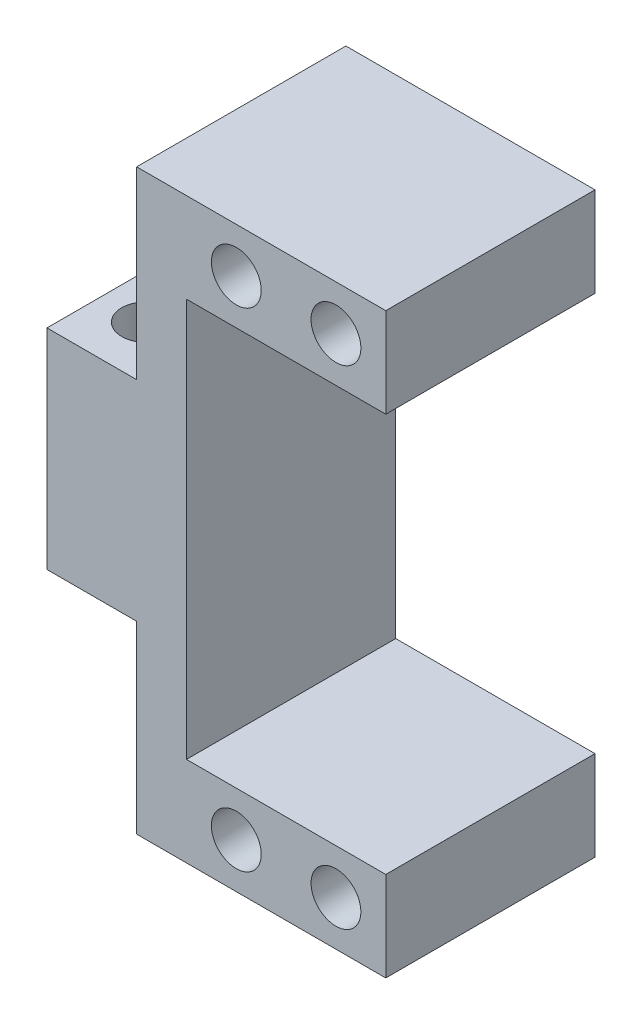
ISO-10303-21;
HEADER;
FILE_DESCRIPTION(('STEP AP214'),'2;1');
FILE_NAME('part.step','',(''),(''),'','','');
FILE_SCHEMA(('AUTOMOTIVE_DESIGN { 1 0 10303 214 1 1 1 1 }'));
ENDSEC;
DATA;
#1=APPLICATION_CONTEXT('core data for automotive mechanical design processes');
#2=APPLICATION_PROTOCOL_DEFINITION('international standard','automotive_design',2000,#1);
#3=PRODUCT_CONTEXT('',#1,'mechanical');
#4=PRODUCT('Part','Part','',(#3));
#5=PRODUCT_RELATED_PRODUCT_CATEGORY('part','',(#4));
#6=PRODUCT_DEFINITION_FORMATION('','',#4);
#7=PRODUCT_DEFINITION_CONTEXT('part definition',#1,'design');
#8=PRODUCT_DEFINITION('design','',#6,#7);
#9=PRODUCT_DEFINITION_SHAPE('','',#8);
#10=(LENGTH_UNIT() NAMED_UNIT(*) SI_UNIT(.MILLI.,.METRE.));
#11=(NAMED_UNIT(*) PLANE_ANGLE_UNIT() SI_UNIT($,.RADIAN.));
#12=(NAMED_UNIT(*) SI_UNIT($,.STERADIAN.) SOLID_ANGLE_UNIT());
#13=UNCERTAINTY_MEASURE_WITH_UNIT(LENGTH_MEASURE(1.E-05),#10,'distance_accuracy_value','');
#14=(GEOMETRIC_REPRESENTATION_CONTEXT(3) GLOBAL_UNCERTAINTY_ASSIGNED_CONTEXT((#13)) GLOBAL_UNIT_ASSIGNED_CONTEXT((#10,
#11,#12)) REPRESENTATION_CONTEXT('',''));
#15=CARTESIAN_POINT('',(0.,0.,0.));
#16=DIRECTION('',(0.,0.,1.));
#17=DIRECTION('',(1.,0.,0.));
#18=AXIS2_PLACEMENT_3D('',#15,#16,#17);
#19=CARTESIAN_POINT('',(0.,10.5,21.));
#20=DIRECTION('',(0.,-1.,0.));
#21=DIRECTION('',(0.,0.,-1.));
#22=AXIS2_PLACEMENT_3D('',#19,#20,#21);
#23=PLANE('',#22);
#24=CARTESIAN_POINT('',(4.5,10.5,15.5));
#25=DIRECTION('',(0.,1.,0.));
#26=DIRECTION('',(0.,0.,-1.));
#27=AXIS2_PLACEMENT_3D('',#24,#25,#26);
#28=CIRCLE('',#27,2.5);
#29=CARTESIAN_POINT('',(4.5,10.5,13.));
#30=VERTEX_POINT('',#29);
#31=EDGE_CURVE('E213',#30,#30,#28,.T.);
#32=ORIENTED_EDGE('',*,*,#31,.F.);
#33=EDGE_LOOP('',(#32));
#34=FACE_BOUND('',#33,.T.);
#35=CARTESIAN_POINT('',(4.5,10.5,5.5));
#36=DIRECTION('',(0.,1.,0.));
#37=DIRECTION('',(0.,0.,1.));
#38=AXIS2_PLACEMENT_3D('',#35,#36,#37);
#39=CIRCLE('',#38,2.5);
#40=CARTESIAN_POINT('',(4.5,10.5,8.));
#41=VERTEX_POINT('',#40);
#42=EDGE_CURVE('E202',#41,#41,#39,.T.);
#43=ORIENTED_EDGE('',*,*,#42,.F.);
#44=EDGE_LOOP('',(#43));
#45=FACE_BOUND('',#44,.T.);
#46=DIRECTION('',(-1.,0.,0.));
#47=VECTOR('',#46,1.);
#48=CARTESIAN_POINT('',(0.,10.5,0.));
#49=LINE('',#48,#47);
#50=CARTESIAN_POINT('',(9.,10.5,0.));
#51=VERTEX_POINT('',#50);
#52=CARTESIAN_POINT('',(0.,10.5,0.));
#53=VERTEX_POINT('',#52);
#54=EDGE_CURVE('E153',#51,#53,#49,.T.);
#55=ORIENTED_EDGE('',*,*,#54,.T.);
#56=DIRECTION('',(0.,0.,-1.));
#57=VECTOR('',#56,1.);
#58=CARTESIAN_POINT('',(0.,10.5,21.));
#59=LINE('',#58,#57);
#60=CARTESIAN_POINT('',(0.,10.5,21.));
#61=VERTEX_POINT('',#60);
#62=EDGE_CURVE('E11',#61,#53,#59,.T.);
#63=ORIENTED_EDGE('',*,*,#62,.F.);
#64=DIRECTION('',(-1.,0.,0.));
#65=VECTOR('',#64,1.);
#66=CARTESIAN_POINT('',(0.,10.5,21.));
#67=LINE('',#66,#65);
#68=CARTESIAN_POINT('',(9.,10.5,21.));
#69=VERTEX_POINT('',#68);
#70=EDGE_CURVE('E176',#69,#61,#67,.T.);
#71=ORIENTED_EDGE('',*,*,#70,.F.);
#72=DIRECTION('',(0.,0.,-1.));
#73=VECTOR('',#72,1.);
#74=CARTESIAN_POINT('',(9.,10.5,21.));
#75=LINE('',#74,#73);
#76=EDGE_CURVE('E149',#69,#51,#75,.T.);
#77=ORIENTED_EDGE('',*,*,#76,.T.);
#78=EDGE_LOOP('',(#55,#63,#71,#77));
#79=FACE_BOUND('',#78,.T.);
#80=ADVANCED_FACE('F31',(#34,#45,#79),#23,.F.);
#81=CARTESIAN_POINT('',(0.,-10.5,21.));
#82=DIRECTION('',(1.,0.,0.));
#83=DIRECTION('',(0.,0.,-1.));
#84=AXIS2_PLACEMENT_3D('',#81,#82,#83);
#85=PLANE('',#84);
#86=DIRECTION('',(0.,-1.,0.));
#87=VECTOR('',#86,1.);
#88=CARTESIAN_POINT('',(0.,-10.5,0.));
#89=LINE('',#88,#87);
#90=CARTESIAN_POINT('',(0.,-10.5,0.));
#91=VERTEX_POINT('',#90);
#92=EDGE_CURVE('E156',#53,#91,#89,.T.);
#93=ORIENTED_EDGE('',*,*,#92,.T.);
#94=DIRECTION('',(0.,0.,-1.));
#95=VECTOR('',#94,1.);
#96=CARTESIAN_POINT('',(0.,-10.5,21.));
#97=LINE('',#96,#95);
#98=CARTESIAN_POINT('',(0.,-10.5,21.));
#99=VERTEX_POINT('',#98);
#100=EDGE_CURVE('E40',#99,#91,#97,.T.);
#101=ORIENTED_EDGE('',*,*,#100,.F.);
#102=DIRECTION('',(0.,-1.,0.));
#103=VECTOR('',#102,1.);
#104=CARTESIAN_POINT('',(0.,-10.5,21.));
#105=LINE('',#104,#103);
#106=EDGE_CURVE('E104',#61,#99,#105,.T.);
#107=ORIENTED_EDGE('',*,*,#106,.F.);
#108=ORIENTED_EDGE('',*,*,#62,.T.);
#109=EDGE_LOOP('',(#93,#101,#107,#108));
#110=FACE_BOUND('',#109,.T.);
#111=ADVANCED_FACE('F277',(#110),#85,.F.);
#112=CARTESIAN_POINT('',(0.,-10.5,21.));
#113=DIRECTION('',(0.,1.,0.));
#114=DIRECTION('',(0.,0.,1.));
#115=AXIS2_PLACEMENT_3D('',#112,#113,#114);
#116=PLANE('',#115);
#117=CARTESIAN_POINT('',(4.5,-10.5,15.5));
#118=DIRECTION('',(0.,1.,0.));
#119=DIRECTION('',(0.,0.,1.));
#120=AXIS2_PLACEMENT_3D('',#117,#118,#119);
#121=CIRCLE('',#120,2.5);
#122=CARTESIAN_POINT('',(4.5,-10.5,18.));
#123=VERTEX_POINT('',#122);
#124=EDGE_CURVE('E34',#123,#123,#121,.T.);
#125=ORIENTED_EDGE('',*,*,#124,.T.);
#126=EDGE_LOOP('',(#125));
#127=FACE_BOUND('',#126,.T.);
#128=CARTESIAN_POINT('',(4.5,-10.5,5.5));
#129=DIRECTION('',(0.,1.,0.));
#130=DIRECTION('',(0.,0.,1.));
#131=AXIS2_PLACEMENT_3D('',#128,#129,#130);
#132=CIRCLE('',#131,2.5);
#133=CARTESIAN_POINT('',(4.5,-10.5,8.));
#134=VERTEX_POINT('',#133);
#135=EDGE_CURVE('E199',#134,#134,#132,.T.);
#136=ORIENTED_EDGE('',*,*,#135,.T.);
#137=EDGE_LOOP('',(#136));
#138=FACE_BOUND('',#137,.T.);
#139=DIRECTION('',(1.,0.,0.));
#140=VECTOR('',#139,1.);
#141=CARTESIAN_POINT('',(0.,-10.5,0.));
#142=LINE('',#141,#140);
#143=CARTESIAN_POINT('',(9.,-10.5,0.));
#144=VERTEX_POINT('',#143);
#145=EDGE_CURVE('E159',#91,#144,#142,.T.);
#146=ORIENTED_EDGE('',*,*,#145,.T.);
#147=DIRECTION('',(0.,0.,-1.));
#148=VECTOR('',#147,1.);
#149=CARTESIAN_POINT('',(9.,-10.5,21.));
#150=LINE('',#149,#148);
#151=CARTESIAN_POINT('',(9.,-10.5,21.));
#152=VERTEX_POINT('',#151);
#153=EDGE_CURVE('E195',#152,#144,#150,.T.);
#154=ORIENTED_EDGE('',*,*,#153,.F.);
#155=DIRECTION('',(1.,0.,0.));
#156=VECTOR('',#155,1.);
#157=CARTESIAN_POINT('',(0.,-10.5,21.));
#158=LINE('',#157,#156);
#159=EDGE_CURVE('E237',#99,#152,#158,.T.);
#160=ORIENTED_EDGE('',*,*,#159,.F.);
#161=ORIENTED_EDGE('',*,*,#100,.T.);
#162=EDGE_LOOP('',(#146,#154,#160,#161));
#163=FACE_BOUND('',#162,.T.);
#164=ADVANCED_FACE('F282',(#127,#138,#163),#116,.F.);
#165=CARTESIAN_POINT('',(9.,-10.5,21.));
#166=DIRECTION('',(1.,0.,0.));
#167=DIRECTION('',(0.,0.,-1.));
#168=AXIS2_PLACEMENT_3D('',#165,#166,#167);
#169=PLANE('',#168);
#170=DIRECTION('',(0.,-1.,0.));
#171=VECTOR('',#170,1.);
#172=CARTESIAN_POINT('',(9.,-10.5,0.));
#173=LINE('',#172,#171);
#174=CARTESIAN_POINT('',(9.,-29.,0.));
#175=VERTEX_POINT('',#174);
#176=EDGE_CURVE('E161',#144,#175,#173,.T.);
#177=ORIENTED_EDGE('',*,*,#176,.T.);
#178=DIRECTION('',(0.,0.,-1.));
#179=VECTOR('',#178,1.);
#180=CARTESIAN_POINT('',(9.,-29.,21.));
#181=LINE('',#180,#179);
#182=CARTESIAN_POINT('',(9.,-29.,21.));
#183=VERTEX_POINT('',#182);
#184=EDGE_CURVE('E192',#183,#175,#181,.T.);
#185=ORIENTED_EDGE('',*,*,#184,.F.);
#186=DIRECTION('',(0.,-1.,0.));
#187=VECTOR('',#186,1.);
#188=CARTESIAN_POINT('',(9.,-10.5,21.));
#189=LINE('',#188,#187);
#190=EDGE_CURVE('E239',#152,#183,#189,.T.);
#191=ORIENTED_EDGE('',*,*,#190,.F.);
#192=ORIENTED_EDGE('',*,*,#153,.T.);
#193=EDGE_LOOP('',(#177,#185,#191,#192));
#194=FACE_BOUND('',#193,.T.);
#195=ADVANCED_FACE('F295',(#194),#169,.F.);
#196=CARTESIAN_POINT('',(9.,-29.,21.));
#197=DIRECTION('',(0.,1.,0.));
#198=DIRECTION('',(0.,0.,1.));
#199=AXIS2_PLACEMENT_3D('',#196,#197,#198);
#200=PLANE('',#199);
#201=DIRECTION('',(1.,0.,0.));
#202=VECTOR('',#201,1.);
#203=CARTESIAN_POINT('',(9.,-29.,0.));
#204=LINE('',#203,#202);
#205=CARTESIAN_POINT('',(34.,-29.,0.));
#206=VERTEX_POINT('',#205);
#207=EDGE_CURVE('E163',#175,#206,#204,.T.);
#208=ORIENTED_EDGE('',*,*,#207,.T.);
#209=DIRECTION('',(0.,0.,-1.));
#210=VECTOR('',#209,1.);
#211=CARTESIAN_POINT('',(34.,-29.,21.));
#212=LINE('',#211,#210);
#213=CARTESIAN_POINT('',(34.,-29.,21.));
#214=VERTEX_POINT('',#213);
#215=EDGE_CURVE('E189',#214,#206,#212,.T.);
#216=ORIENTED_EDGE('',*,*,#215,.F.);
#217=DIRECTION('',(1.,0.,0.));
#218=VECTOR('',#217,1.);
#219=CARTESIAN_POINT('',(9.,-29.,21.));
#220=LINE('',#219,#218);
#221=EDGE_CURVE('E241',#183,#214,#220,.T.);
#222=ORIENTED_EDGE('',*,*,#221,.F.);
#223=ORIENTED_EDGE('',*,*,#184,.T.);
#224=EDGE_LOOP('',(#208,#216,#222,#223));
#225=FACE_BOUND('',#224,.T.);
#226=ADVANCED_FACE('F309',(#225),#200,.F.);
#227=CARTESIAN_POINT('',(34.,-29.,21.));
#228=DIRECTION('',(-1.,0.,0.));
#229=DIRECTION('',(0.,0.,1.));
#230=AXIS2_PLACEMENT_3D('',#227,#228,#229);
#231=PLANE('',#230);
#232=DIRECTION('',(0.,1.,0.));
#233=VECTOR('',#232,1.);
#234=CARTESIAN_POINT('',(34.,-29.,0.));
#235=LINE('',#234,#233);
#236=CARTESIAN_POINT('',(34.,-20.,0.));
#237=VERTEX_POINT('',#236);
#238=EDGE_CURVE('E165',#206,#237,#235,.T.);
#239=ORIENTED_EDGE('',*,*,#238,.T.);
#240=DIRECTION('',(0.,0.,-1.));
#241=VECTOR('',#240,1.);
#242=CARTESIAN_POINT('',(34.,-20.,21.));
#243=LINE('',#242,#241);
#244=CARTESIAN_POINT('',(34.,-20.,21.));
#245=VERTEX_POINT('',#244);
#246=EDGE_CURVE('E186',#245,#237,#243,.T.);
#247=ORIENTED_EDGE('',*,*,#246,.F.);
#248=DIRECTION('',(0.,1.,0.));
#249=VECTOR('',#248,1.);
#250=CARTESIAN_POINT('',(34.,-29.,21.));
#251=LINE('',#250,#249);
#252=EDGE_CURVE('E243',#214,#245,#251,.T.);
#253=ORIENTED_EDGE('',*,*,#252,.F.);
#254=ORIENTED_EDGE('',*,*,#215,.T.);
#255=EDGE_LOOP('',(#239,#247,#253,#254));
#256=FACE_BOUND('',#255,.T.);
#257=ADVANCED_FACE('F313',(#256),#231,.F.);
#258=CARTESIAN_POINT('',(34.,-20.,21.));
#259=DIRECTION('',(0.,-1.,0.));
#260=DIRECTION('',(1.,0.,0.));
#261=AXIS2_PLACEMENT_3D('',#258,#259,#260);
#262=PLANE('',#261);
#263=DIRECTION('',(-1.,0.,0.));
#264=VECTOR('',#263,1.);
#265=CARTESIAN_POINT('',(34.,-20.,0.));
#266=LINE('',#265,#264);
#267=CARTESIAN_POINT('',(14.,-20.,0.));
#268=VERTEX_POINT('',#267);
#269=EDGE_CURVE('E167',#237,#268,#266,.T.);
#270=ORIENTED_EDGE('',*,*,#269,.T.);
#271=DIRECTION('',(0.,0.,-1.));
#272=VECTOR('',#271,1.);
#273=CARTESIAN_POINT('',(14.,-20.,21.));
#274=LINE('',#273,#272);
#275=CARTESIAN_POINT('',(14.,-20.,21.));
#276=VERTEX_POINT('',#275);
#277=EDGE_CURVE('E183',#276,#268,#274,.T.);
#278=ORIENTED_EDGE('',*,*,#277,.F.);
#279=DIRECTION('',(-1.,0.,0.));
#280=VECTOR('',#279,1.);
#281=CARTESIAN_POINT('',(34.,-20.,21.));
#282=LINE('',#281,#280);
#283=EDGE_CURVE('E245',#245,#276,#282,.T.);
#284=ORIENTED_EDGE('',*,*,#283,.F.);
#285=ORIENTED_EDGE('',*,*,#246,.T.);
#286=EDGE_LOOP('',(#270,#278,#284,#285));
#287=FACE_BOUND('',#286,.T.);
#288=ADVANCED_FACE('F316',(#287),#262,.F.);
#289=CARTESIAN_POINT('',(14.,20.,21.));
#290=DIRECTION('',(-1.,0.,0.));
#291=DIRECTION('',(0.,0.,1.));
#292=AXIS2_PLACEMENT_3D('',#289,#290,#291);
#293=PLANE('',#292);
#294=DIRECTION('',(0.,1.,0.));
#295=VECTOR('',#294,1.);
#296=CARTESIAN_POINT('',(14.,20.,0.));
#297=LINE('',#296,#295);
#298=CARTESIAN_POINT('',(14.,20.,0.));
#299=VERTEX_POINT('',#298);
#300=EDGE_CURVE('E169',#268,#299,#297,.T.);
#301=ORIENTED_EDGE('',*,*,#300,.T.);
#302=DIRECTION('',(0.,0.,-1.));
#303=VECTOR('',#302,1.);
#304=CARTESIAN_POINT('',(14.,20.,21.));
#305=LINE('',#304,#303);
#306=CARTESIAN_POINT('',(14.,20.,21.));
#307=VERTEX_POINT('',#306);
#308=EDGE_CURVE('E180',#307,#299,#305,.T.);
#309=ORIENTED_EDGE('',*,*,#308,.F.);
#310=DIRECTION('',(0.,1.,0.));
#311=VECTOR('',#310,1.);
#312=CARTESIAN_POINT('',(14.,20.,21.));
#313=LINE('',#312,#311);
#314=EDGE_CURVE('E247',#276,#307,#313,.T.);
#315=ORIENTED_EDGE('',*,*,#314,.F.);
#316=ORIENTED_EDGE('',*,*,#277,.T.);
#317=EDGE_LOOP('',(#301,#309,#315,#316));
#318=FACE_BOUND('',#317,.T.);
#319=ADVANCED_FACE('F253',(#318),#293,.F.);
#320=CARTESIAN_POINT('',(34.,20.,21.));
#321=DIRECTION('',(0.,1.,0.));
#322=DIRECTION('',(-1.,0.,0.));
#323=AXIS2_PLACEMENT_3D('',#320,#321,#322);
#324=PLANE('',#323);
#325=DIRECTION('',(1.,0.,0.));
#326=VECTOR('',#325,1.);
#327=CARTESIAN_POINT('',(34.,20.,0.));
#328=LINE('',#327,#326);
#329=CARTESIAN_POINT('',(34.,20.,0.));
#330=VERTEX_POINT('',#329);
#331=EDGE_CURVE('E171',#299,#330,#328,.T.);
#332=ORIENTED_EDGE('',*,*,#331,.T.);
#333=DIRECTION('',(0.,0.,-1.));
#334=VECTOR('',#333,1.);
#335=CARTESIAN_POINT('',(34.,20.,21.));
#336=LINE('',#335,#334);
#337=CARTESIAN_POINT('',(34.,20.,21.));
#338=VERTEX_POINT('',#337);
#339=EDGE_CURVE('E144',#338,#330,#336,.T.);
#340=ORIENTED_EDGE('',*,*,#339,.F.);
#341=DIRECTION('',(1.,0.,0.));
#342=VECTOR('',#341,1.);
#343=CARTESIAN_POINT('',(34.,20.,21.));
#344=LINE('',#343,#342);
#345=EDGE_CURVE('E135',#307,#338,#344,.T.);
#346=ORIENTED_EDGE('',*,*,#345,.F.);
#347=ORIENTED_EDGE('',*,*,#308,.T.);
#348=EDGE_LOOP('',(#332,#340,#346,#347));
#349=FACE_BOUND('',#348,.T.);
#350=ADVANCED_FACE('F257',(#349),#324,.F.);
#351=CARTESIAN_POINT('',(34.,29.,21.));
#352=DIRECTION('',(-1.,0.,0.));
#353=DIRECTION('',(0.,0.,1.));
#354=AXIS2_PLACEMENT_3D('',#351,#352,#353);
#355=PLANE('',#354);
#356=DIRECTION('',(0.,1.,0.));
#357=VECTOR('',#356,1.);
#358=CARTESIAN_POINT('',(34.,29.,0.));
#359=LINE('',#358,#357);
#360=CARTESIAN_POINT('',(34.,29.,0.));
#361=VERTEX_POINT('',#360);
#362=EDGE_CURVE('E143',#330,#361,#359,.T.);
#363=ORIENTED_EDGE('',*,*,#362,.T.);
#364=DIRECTION('',(0.,0.,-1.));
#365=VECTOR('',#364,1.);
#366=CARTESIAN_POINT('',(34.,29.,21.));
#367=LINE('',#366,#365);
#368=CARTESIAN_POINT('',(34.,29.,21.));
#369=VERTEX_POINT('',#368);
#370=EDGE_CURVE('E140',#369,#361,#367,.T.);
#371=ORIENTED_EDGE('',*,*,#370,.F.);
#372=DIRECTION('',(0.,1.,0.));
#373=VECTOR('',#372,1.);
#374=CARTESIAN_POINT('',(34.,29.,21.));
#375=LINE('',#374,#373);
#376=EDGE_CURVE('E129',#338,#369,#375,.T.);
#377=ORIENTED_EDGE('',*,*,#376,.F.);
#378=ORIENTED_EDGE('',*,*,#339,.T.);
#379=EDGE_LOOP('',(#363,#371,#377,#378));
#380=FACE_BOUND('',#379,.T.);
#381=ADVANCED_FACE('F141',(#380),#355,.F.);
#382=CARTESIAN_POINT('',(9.,29.,21.));
#383=DIRECTION('',(0.,-1.,0.));
#384=DIRECTION('',(0.,0.,-1.));
#385=AXIS2_PLACEMENT_3D('',#382,#383,#384);
#386=PLANE('',#385);
#387=DIRECTION('',(-1.,0.,0.));
#388=VECTOR('',#387,1.);
#389=CARTESIAN_POINT('',(9.,29.,0.));
#390=LINE('',#389,#388);
#391=CARTESIAN_POINT('',(9.,29.,0.));
#392=VERTEX_POINT('',#391);
#393=EDGE_CURVE('E90',#361,#392,#390,.T.);
#394=ORIENTED_EDGE('',*,*,#393,.T.);
#395=DIRECTION('',(0.,0.,-1.));
#396=VECTOR('',#395,1.);
#397=CARTESIAN_POINT('',(9.,29.,21.));
#398=LINE('',#397,#396);
#399=CARTESIAN_POINT('',(9.,29.,21.));
#400=VERTEX_POINT('',#399);
#401=EDGE_CURVE('E145',#400,#392,#398,.T.);
#402=ORIENTED_EDGE('',*,*,#401,.F.);
#403=DIRECTION('',(-1.,0.,0.));
#404=VECTOR('',#403,1.);
#405=CARTESIAN_POINT('',(9.,29.,21.));
#406=LINE('',#405,#404);
#407=EDGE_CURVE('E133',#369,#400,#406,.T.);
#408=ORIENTED_EDGE('',*,*,#407,.F.);
#409=ORIENTED_EDGE('',*,*,#370,.T.);
#410=EDGE_LOOP('',(#394,#402,#408,#409));
#411=FACE_BOUND('',#410,.T.);
#412=ADVANCED_FACE('F147',(#411),#386,.F.);
#413=CARTESIAN_POINT('',(9.,10.5,21.));
#414=DIRECTION('',(1.,0.,0.));
#415=DIRECTION('',(0.,0.,-1.));
#416=AXIS2_PLACEMENT_3D('',#413,#414,#415);
#417=PLANE('',#416);
#418=DIRECTION('',(0.,-1.,0.));
#419=VECTOR('',#418,1.);
#420=CARTESIAN_POINT('',(9.,10.5,0.));
#421=LINE('',#420,#419);
#422=EDGE_CURVE('E96',#392,#51,#421,.T.);
#423=ORIENTED_EDGE('',*,*,#422,.T.);
#424=ORIENTED_EDGE('',*,*,#76,.F.);
#425=DIRECTION('',(0.,-1.,0.));
#426=VECTOR('',#425,1.);
#427=CARTESIAN_POINT('',(9.,10.5,21.));
#428=LINE('',#427,#426);
#429=EDGE_CURVE('E49',#400,#69,#428,.T.);
#430=ORIENTED_EDGE('',*,*,#429,.F.);
#431=ORIENTED_EDGE('',*,*,#401,.T.);
#432=EDGE_LOOP('',(#423,#424,#430,#431));
#433=FACE_BOUND('',#432,.T.);
#434=ADVANCED_FACE('F265',(#433),#417,.F.);
#435=CARTESIAN_POINT('',(9.,10.5,21.));
#436=DIRECTION('',(0.,0.,1.));
#437=DIRECTION('',(1.,0.,0.));
#438=AXIS2_PLACEMENT_3D('',#435,#436,#437);
#439=PLANE('',#438);
#440=CARTESIAN_POINT('',(29.,-24.5,21.));
#441=DIRECTION('',(0.,0.,1.));
#442=DIRECTION('',(1.,0.,0.));
#443=AXIS2_PLACEMENT_3D('',#440,#441,#442);
#444=CIRCLE('',#443,2.49999999999999);
#445=CARTESIAN_POINT('',(31.5,-24.5,21.));
#446=VERTEX_POINT('',#445);
#447=EDGE_CURVE('E201',#446,#446,#444,.T.);
#448=ORIENTED_EDGE('',*,*,#447,.F.);
#449=EDGE_LOOP('',(#448));
#450=FACE_BOUND('',#449,.T.);
#451=CARTESIAN_POINT('',(19.,-24.5,21.));
#452=DIRECTION('',(0.,0.,1.));
#453=DIRECTION('',(-1.,0.,0.));
#454=AXIS2_PLACEMENT_3D('',#451,#452,#453);
#455=CIRCLE('',#454,2.5);
#456=CARTESIAN_POINT('',(16.5,-24.5,21.));
#457=VERTEX_POINT('',#456);
#458=EDGE_CURVE('E217',#457,#457,#455,.T.);
#459=ORIENTED_EDGE('',*,*,#458,.F.);
#460=EDGE_LOOP('',(#459));
#461=FACE_BOUND('',#460,.T.);
#462=CARTESIAN_POINT('',(19.,24.5,21.));
#463=DIRECTION('',(0.,0.,1.));
#464=DIRECTION('',(1.,0.,0.));
#465=AXIS2_PLACEMENT_3D('',#462,#463,#464);
#466=CIRCLE('',#465,2.5);
#467=CARTESIAN_POINT('',(21.5,24.5,21.));
#468=VERTEX_POINT('',#467);
#469=EDGE_CURVE('E222',#468,#468,#466,.T.);
#470=ORIENTED_EDGE('',*,*,#469,.F.);
#471=EDGE_LOOP('',(#470));
#472=FACE_BOUND('',#471,.T.);
#473=CARTESIAN_POINT('',(29.,24.5,21.));
#474=DIRECTION('',(0.,0.,1.));
#475=DIRECTION('',(-1.,0.,0.));
#476=AXIS2_PLACEMENT_3D('',#473,#474,#475);
#477=CIRCLE('',#476,2.49999999999999);
#478=CARTESIAN_POINT('',(26.5,24.5,21.));
#479=VERTEX_POINT('',#478);
#480=EDGE_CURVE('E228',#479,#479,#477,.T.);
#481=ORIENTED_EDGE('',*,*,#480,.F.);
#482=EDGE_LOOP('',(#481));
#483=FACE_BOUND('',#482,.T.);
#484=ORIENTED_EDGE('',*,*,#70,.T.);
#485=ORIENTED_EDGE('',*,*,#106,.T.);
#486=ORIENTED_EDGE('',*,*,#159,.T.);
#487=ORIENTED_EDGE('',*,*,#190,.T.);
#488=ORIENTED_EDGE('',*,*,#221,.T.);
#489=ORIENTED_EDGE('',*,*,#252,.T.);
#490=ORIENTED_EDGE('',*,*,#283,.T.);
#491=ORIENTED_EDGE('',*,*,#314,.T.);
#492=ORIENTED_EDGE('',*,*,#345,.T.);
#493=ORIENTED_EDGE('',*,*,#376,.T.);
#494=ORIENTED_EDGE('',*,*,#407,.T.);
#495=ORIENTED_EDGE('',*,*,#429,.T.);
#496=EDGE_LOOP('',(#484,#485,#486,#487,#488,#489,#490,#491,#492,#493,#494,#495));
#497=FACE_BOUND('',#496,.T.);
#498=ADVANCED_FACE('F131',(#450,#461,#472,#483,#497),#439,.T.);
#499=CARTESIAN_POINT('',(9.,10.5,0.));
#500=DIRECTION('',(0.,0.,1.));
#501=DIRECTION('',(1.,0.,0.));
#502=AXIS2_PLACEMENT_3D('',#499,#500,#501);
#503=PLANE('',#502);
#504=CARTESIAN_POINT('',(29.,-24.5,0.));
#505=DIRECTION('',(0.,0.,1.));
#506=DIRECTION('',(1.,0.,0.));
#507=AXIS2_PLACEMENT_3D('',#504,#505,#506);
#508=CIRCLE('',#507,2.49999999999999);
#509=CARTESIAN_POINT('',(31.5,-24.5,0.));
#510=VERTEX_POINT('',#509);
#511=EDGE_CURVE('E206',#510,#510,#508,.T.);
#512=ORIENTED_EDGE('',*,*,#511,.T.);
#513=EDGE_LOOP('',(#512));
#514=FACE_BOUND('',#513,.T.);
#515=CARTESIAN_POINT('',(19.,-24.5,0.));
#516=DIRECTION('',(0.,0.,1.));
#517=DIRECTION('',(-1.,0.,0.));
#518=AXIS2_PLACEMENT_3D('',#515,#516,#517);
#519=CIRCLE('',#518,2.5);
#520=CARTESIAN_POINT('',(16.5,-24.5,0.));
#521=VERTEX_POINT('',#520);
#522=EDGE_CURVE('E219',#521,#521,#519,.T.);
#523=ORIENTED_EDGE('',*,*,#522,.T.);
#524=EDGE_LOOP('',(#523));
#525=FACE_BOUND('',#524,.T.);
#526=CARTESIAN_POINT('',(19.,24.5,0.));
#527=DIRECTION('',(0.,0.,1.));
#528=DIRECTION('',(1.,0.,0.));
#529=AXIS2_PLACEMENT_3D('',#526,#527,#528);
#530=CIRCLE('',#529,2.5);
#531=CARTESIAN_POINT('',(21.5,24.5,0.));
#532=VERTEX_POINT('',#531);
#533=EDGE_CURVE('E225',#532,#532,#530,.T.);
#534=ORIENTED_EDGE('',*,*,#533,.T.);
#535=EDGE_LOOP('',(#534));
#536=FACE_BOUND('',#535,.T.);
#537=CARTESIAN_POINT('',(29.,24.5,0.));
#538=DIRECTION('',(0.,0.,1.));
#539=DIRECTION('',(-1.,0.,0.));
#540=AXIS2_PLACEMENT_3D('',#537,#538,#539);
#541=CIRCLE('',#540,2.49999999999999);
#542=CARTESIAN_POINT('',(26.5,24.5,0.));
#543=VERTEX_POINT('',#542);
#544=EDGE_CURVE('E157',#543,#543,#541,.T.);
#545=ORIENTED_EDGE('',*,*,#544,.T.);
#546=EDGE_LOOP('',(#545));
#547=FACE_BOUND('',#546,.T.);
#548=ORIENTED_EDGE('',*,*,#54,.F.);
#549=ORIENTED_EDGE('',*,*,#422,.F.);
#550=ORIENTED_EDGE('',*,*,#393,.F.);
#551=ORIENTED_EDGE('',*,*,#362,.F.);
#552=ORIENTED_EDGE('',*,*,#331,.F.);
#553=ORIENTED_EDGE('',*,*,#300,.F.);
#554=ORIENTED_EDGE('',*,*,#269,.F.);
#555=ORIENTED_EDGE('',*,*,#238,.F.);
#556=ORIENTED_EDGE('',*,*,#207,.F.);
#557=ORIENTED_EDGE('',*,*,#176,.F.);
#558=ORIENTED_EDGE('',*,*,#145,.F.);
#559=ORIENTED_EDGE('',*,*,#92,.F.);
#560=EDGE_LOOP('',(#548,#549,#550,#551,#552,#553,#554,#555,#556,#557,#558,#559));
#561=FACE_BOUND('',#560,.T.);
#562=ADVANCED_FACE('F260',(#514,#525,#536,#547,#561),#503,.F.);
#563=CARTESIAN_POINT('',(29.,24.5,0.));
#564=DIRECTION('',(0.,0.,1.));
#565=DIRECTION('',(1.,0.,0.));
#566=AXIS2_PLACEMENT_3D('',#563,#564,#565);
#567=CYLINDRICAL_SURFACE('',#566,2.49999999999999);
#568=ORIENTED_EDGE('',*,*,#544,.F.);
#569=EDGE_LOOP('',(#568));
#570=FACE_BOUND('',#569,.T.);
#571=ORIENTED_EDGE('',*,*,#480,.T.);
#572=EDGE_LOOP('',(#571));
#573=FACE_BOUND('',#572,.T.);
#574=ADVANCED_FACE('F393',(#570,#573),#567,.F.);
#575=CARTESIAN_POINT('',(19.,24.5,0.));
#576=DIRECTION('',(0.,0.,1.));
#577=DIRECTION('',(1.,0.,0.));
#578=AXIS2_PLACEMENT_3D('',#575,#576,#577);
#579=CYLINDRICAL_SURFACE('',#578,2.5);
#580=ORIENTED_EDGE('',*,*,#533,.F.);
#581=EDGE_LOOP('',(#580));
#582=FACE_BOUND('',#581,.T.);
#583=ORIENTED_EDGE('',*,*,#469,.T.);
#584=EDGE_LOOP('',(#583));
#585=FACE_BOUND('',#584,.T.);
#586=ADVANCED_FACE('F402',(#582,#585),#579,.F.);
#587=CARTESIAN_POINT('',(19.,-24.5,0.));
#588=DIRECTION('',(0.,0.,1.));
#589=DIRECTION('',(1.,0.,0.));
#590=AXIS2_PLACEMENT_3D('',#587,#588,#589);
#591=CYLINDRICAL_SURFACE('',#590,2.5);
#592=ORIENTED_EDGE('',*,*,#522,.F.);
#593=EDGE_LOOP('',(#592));
#594=FACE_BOUND('',#593,.T.);
#595=ORIENTED_EDGE('',*,*,#458,.T.);
#596=EDGE_LOOP('',(#595));
#597=FACE_BOUND('',#596,.T.);
#598=ADVANCED_FACE('F412',(#594,#597),#591,.F.);
#599=CARTESIAN_POINT('',(29.,-24.5,0.));
#600=DIRECTION('',(0.,0.,1.));
#601=DIRECTION('',(1.,0.,0.));
#602=AXIS2_PLACEMENT_3D('',#599,#600,#601);
#603=CYLINDRICAL_SURFACE('',#602,2.49999999999999);
#604=ORIENTED_EDGE('',*,*,#511,.F.);
#605=EDGE_LOOP('',(#604));
#606=FACE_BOUND('',#605,.T.);
#607=ORIENTED_EDGE('',*,*,#447,.T.);
#608=EDGE_LOOP('',(#607));
#609=FACE_BOUND('',#608,.T.);
#610=ADVANCED_FACE('F422',(#606,#609),#603,.F.);
#611=CARTESIAN_POINT('',(4.5,-29.,5.5));
#612=DIRECTION('',(0.,1.,0.));
#613=DIRECTION('',(0.,0.,1.));
#614=AXIS2_PLACEMENT_3D('',#611,#612,#613);
#615=CYLINDRICAL_SURFACE('',#614,2.5);
#616=ORIENTED_EDGE('',*,*,#42,.T.);
#617=EDGE_LOOP('',(#616));
#618=FACE_BOUND('',#617,.T.);
#619=ORIENTED_EDGE('',*,*,#135,.F.);
#620=EDGE_LOOP('',(#619));
#621=FACE_BOUND('',#620,.T.);
#622=ADVANCED_FACE('F290',(#618,#621),#615,.F.);
#623=CARTESIAN_POINT('',(4.5,-29.,15.5));
#624=DIRECTION('',(0.,1.,0.));
#625=DIRECTION('',(0.,0.,1.));
#626=AXIS2_PLACEMENT_3D('',#623,#624,#625);
#627=CYLINDRICAL_SURFACE('',#626,2.5);
#628=ORIENTED_EDGE('',*,*,#31,.T.);
#629=EDGE_LOOP('',(#628));
#630=FACE_BOUND('',#629,.T.);
#631=ORIENTED_EDGE('',*,*,#124,.F.);
#632=EDGE_LOOP('',(#631));
#633=FACE_BOUND('',#632,.T.);
#634=ADVANCED_FACE('F287',(#630,#633),#627,.F.);
#635=CLOSED_SHELL('',(#80,#111,#164,#195,#226,#257,#288,#319,#350,#381,#412,#434,#498,#562,#574,
#586,#598,#610,#622,#634));
#636=MANIFOLD_SOLID_BREP('B2',#635);
#637=ADVANCED_BREP_SHAPE_REPRESENTATION('',(#18,#636),#14);
#638=SHAPE_DEFINITION_REPRESENTATION(#9,#637);
ENDSEC;
END-ISO-10303-21;
